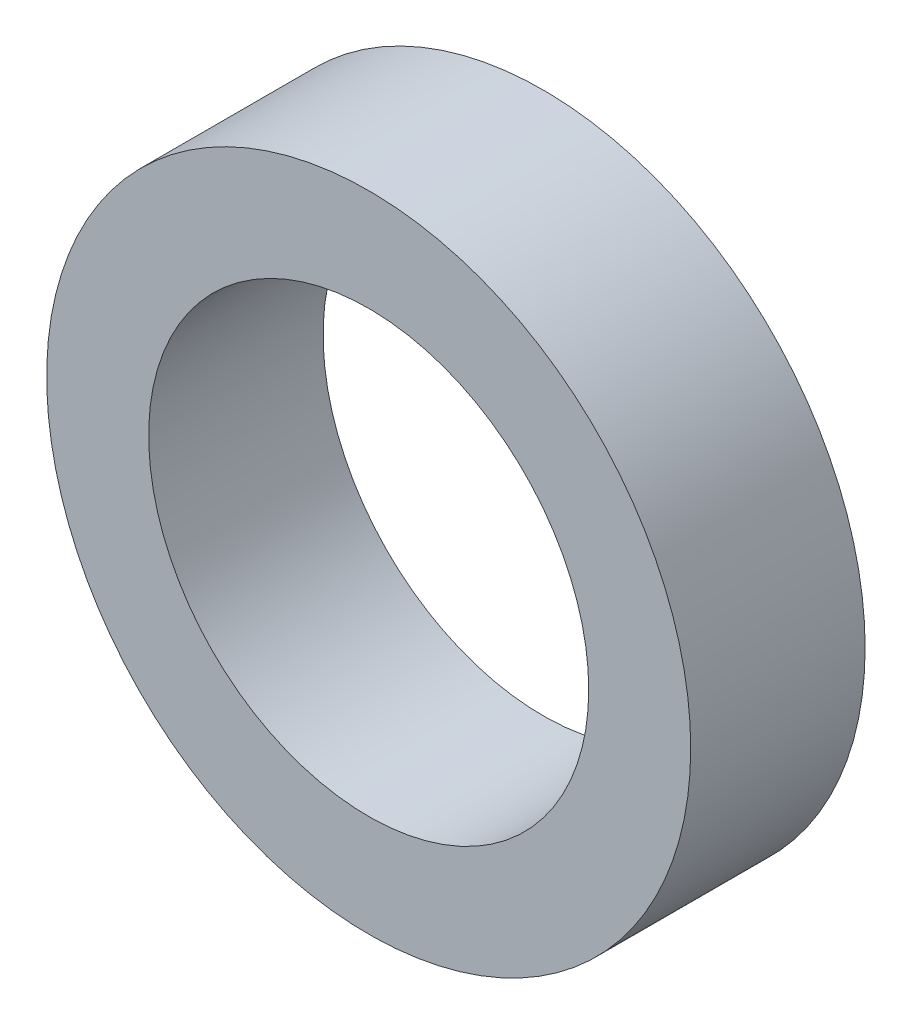
ISO-10303-21;
HEADER;
FILE_DESCRIPTION(('STEP AP214'),'2;1');
FILE_NAME('part.step','',(''),(''),'','','');
FILE_SCHEMA(('AUTOMOTIVE_DESIGN { 1 0 10303 214 1 1 1 1 }'));
ENDSEC;
DATA;
#1=APPLICATION_CONTEXT('core data for automotive mechanical design processes');
#2=APPLICATION_PROTOCOL_DEFINITION('international standard','automotive_design',2000,#1);
#3=PRODUCT_CONTEXT('',#1,'mechanical');
#4=PRODUCT('Part','Part','',(#3));
#5=PRODUCT_RELATED_PRODUCT_CATEGORY('part','',(#4));
#6=PRODUCT_DEFINITION_FORMATION('','',#4);
#7=PRODUCT_DEFINITION_CONTEXT('part definition',#1,'design');
#8=PRODUCT_DEFINITION('design','',#6,#7);
#9=PRODUCT_DEFINITION_SHAPE('','',#8);
#10=(LENGTH_UNIT() NAMED_UNIT(*) SI_UNIT(.MILLI.,.METRE.));
#11=(NAMED_UNIT(*) PLANE_ANGLE_UNIT() SI_UNIT($,.RADIAN.));
#12=(NAMED_UNIT(*) SI_UNIT($,.STERADIAN.) SOLID_ANGLE_UNIT());
#13=UNCERTAINTY_MEASURE_WITH_UNIT(LENGTH_MEASURE(1.E-05),#10,'distance_accuracy_value','');
#14=(GEOMETRIC_REPRESENTATION_CONTEXT(3) GLOBAL_UNCERTAINTY_ASSIGNED_CONTEXT((#13)) GLOBAL_UNIT_ASSIGNED_CONTEXT((#10,
#11,#12)) REPRESENTATION_CONTEXT('',''));
#15=CARTESIAN_POINT('',(0.,0.,0.));
#16=DIRECTION('',(0.,0.,1.));
#17=DIRECTION('',(1.,0.,0.));
#18=AXIS2_PLACEMENT_3D('',#15,#16,#17);
#19=CARTESIAN_POINT('',(0.,0.,1.625));
#20=DIRECTION('',(0.,0.,1.));
#21=DIRECTION('',(1.,0.,0.));
#22=AXIS2_PLACEMENT_3D('',#19,#20,#21);
#23=PLANE('',#22);
#24=CARTESIAN_POINT('',(0.,0.,1.625));
#25=DIRECTION('',(0.,0.,1.));
#26=DIRECTION('',(1.,0.,0.));
#27=AXIS2_PLACEMENT_3D('',#24,#25,#26);
#28=CIRCLE('',#27,6.);
#29=CARTESIAN_POINT('',(6.,0.,1.625));
#30=VERTEX_POINT('',#29);
#31=EDGE_CURVE('E10',#30,#30,#28,.T.);
#32=ORIENTED_EDGE('',*,*,#31,.T.);
#33=EDGE_LOOP('',(#32));
#34=FACE_BOUND('',#33,.T.);
#35=CARTESIAN_POINT('',(0.,0.,1.625));
#36=DIRECTION('',(0.,0.,1.));
#37=DIRECTION('',(1.,0.,0.));
#38=AXIS2_PLACEMENT_3D('',#35,#36,#37);
#39=CIRCLE('',#38,4.1);
#40=CARTESIAN_POINT('',(4.1,0.,1.625));
#41=VERTEX_POINT('',#40);
#42=EDGE_CURVE('E54',#41,#41,#39,.T.);
#43=ORIENTED_EDGE('',*,*,#42,.F.);
#44=EDGE_LOOP('',(#43));
#45=FACE_BOUND('',#44,.T.);
#46=ADVANCED_FACE('F41',(#34,#45),#23,.T.);
#47=CARTESIAN_POINT('',(0.,0.,-1.625));
#48=DIRECTION('',(0.,0.,1.));
#49=DIRECTION('',(1.,0.,0.));
#50=AXIS2_PLACEMENT_3D('',#47,#48,#49);
#51=PLANE('',#50);
#52=CARTESIAN_POINT('',(0.,0.,-1.625));
#53=DIRECTION('',(0.,0.,1.));
#54=DIRECTION('',(1.,0.,0.));
#55=AXIS2_PLACEMENT_3D('',#52,#53,#54);
#56=CIRCLE('',#55,6.);
#57=CARTESIAN_POINT('',(6.,0.,-1.625));
#58=VERTEX_POINT('',#57);
#59=EDGE_CURVE('E45',#58,#58,#56,.T.);
#60=ORIENTED_EDGE('',*,*,#59,.F.);
#61=EDGE_LOOP('',(#60));
#62=FACE_BOUND('',#61,.T.);
#63=CARTESIAN_POINT('',(0.,0.,-1.625));
#64=DIRECTION('',(0.,0.,1.));
#65=DIRECTION('',(1.,0.,0.));
#66=AXIS2_PLACEMENT_3D('',#63,#64,#65);
#67=CIRCLE('',#66,4.1);
#68=CARTESIAN_POINT('',(4.1,0.,-1.625));
#69=VERTEX_POINT('',#68);
#70=EDGE_CURVE('E56',#69,#69,#67,.T.);
#71=ORIENTED_EDGE('',*,*,#70,.T.);
#72=EDGE_LOOP('',(#71));
#73=FACE_BOUND('',#72,.T.);
#74=ADVANCED_FACE('F68',(#62,#73),#51,.F.);
#75=CARTESIAN_POINT('',(0.,0.,1.625));
#76=DIRECTION('',(0.,0.,-1.));
#77=DIRECTION('',(-1.,0.,0.));
#78=AXIS2_PLACEMENT_3D('',#75,#76,#77);
#79=CYLINDRICAL_SURFACE('',#78,6.);
#80=ORIENTED_EDGE('',*,*,#31,.F.);
#81=EDGE_LOOP('',(#80));
#82=FACE_BOUND('',#81,.T.);
#83=ORIENTED_EDGE('',*,*,#59,.T.);
#84=EDGE_LOOP('',(#83));
#85=FACE_BOUND('',#84,.T.);
#86=ADVANCED_FACE('F43',(#82,#85),#79,.T.);
#87=CARTESIAN_POINT('',(0.,0.,1.625));
#88=DIRECTION('',(0.,0.,-1.));
#89=DIRECTION('',(-1.,0.,0.));
#90=AXIS2_PLACEMENT_3D('',#87,#88,#89);
#91=CYLINDRICAL_SURFACE('',#90,4.1);
#92=ORIENTED_EDGE('',*,*,#42,.T.);
#93=EDGE_LOOP('',(#92));
#94=FACE_BOUND('',#93,.T.);
#95=ORIENTED_EDGE('',*,*,#70,.F.);
#96=EDGE_LOOP('',(#95));
#97=FACE_BOUND('',#96,.T.);
#98=ADVANCED_FACE('F64',(#94,#97),#91,.F.);
#99=CLOSED_SHELL('',(#46,#74,#86,#98));
#100=MANIFOLD_SOLID_BREP('B2',#99);
#101=ADVANCED_BREP_SHAPE_REPRESENTATION('',(#18,#100),#14);
#102=SHAPE_DEFINITION_REPRESENTATION(#9,#101);
ENDSEC;
END-ISO-10303-21;
